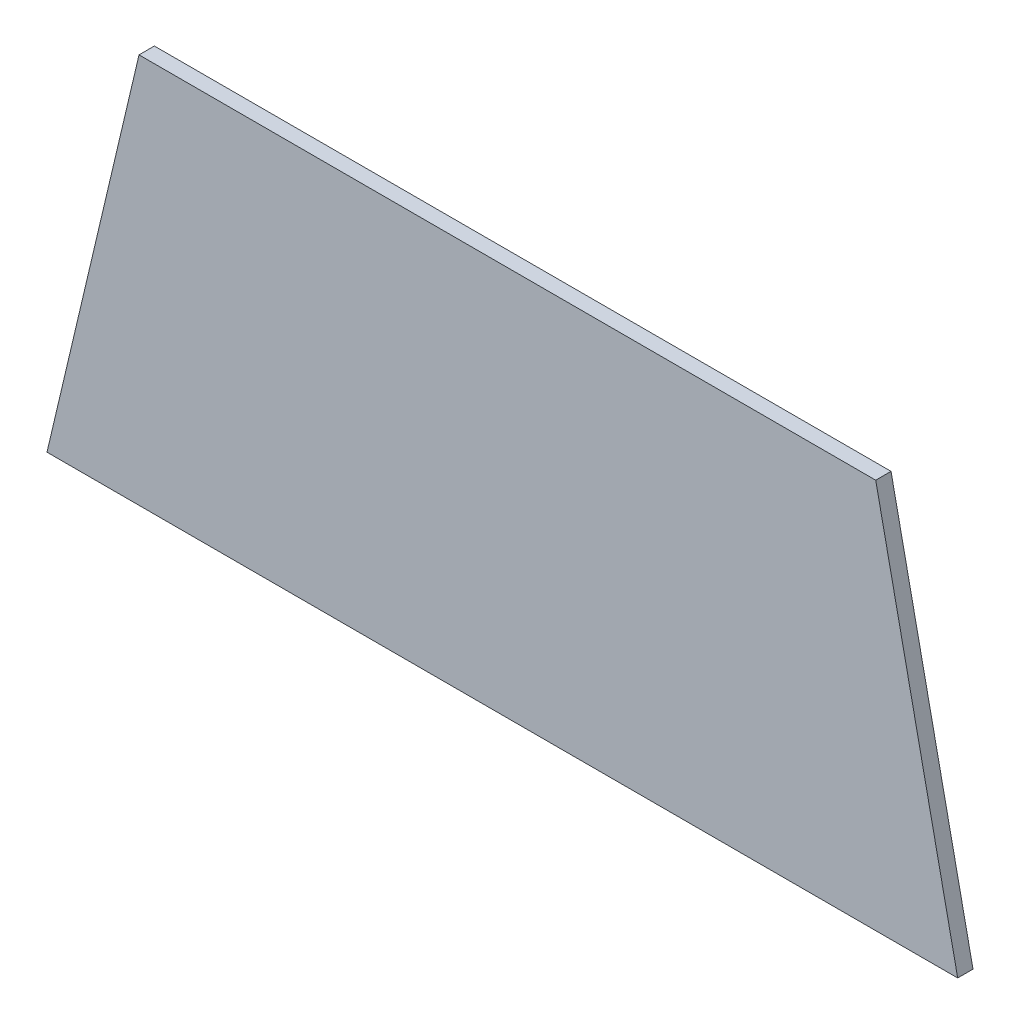
ISO-10303-21;
HEADER;
FILE_DESCRIPTION(('STEP AP214'),'2;1');
FILE_NAME('part.step','',(''),(''),'','','');
FILE_SCHEMA(('AUTOMOTIVE_DESIGN { 1 0 10303 214 1 1 1 1 }'));
ENDSEC;
DATA;
#1=APPLICATION_CONTEXT('core data for automotive mechanical design processes');
#2=APPLICATION_PROTOCOL_DEFINITION('international standard','automotive_design',2000,#1);
#3=PRODUCT_CONTEXT('',#1,'mechanical');
#4=PRODUCT('Part','Part','',(#3));
#5=PRODUCT_RELATED_PRODUCT_CATEGORY('part','',(#4));
#6=PRODUCT_DEFINITION_FORMATION('','',#4);
#7=PRODUCT_DEFINITION_CONTEXT('part definition',#1,'design');
#8=PRODUCT_DEFINITION('design','',#6,#7);
#9=PRODUCT_DEFINITION_SHAPE('','',#8);
#10=(LENGTH_UNIT() NAMED_UNIT(*) SI_UNIT(.MILLI.,.METRE.));
#11=(NAMED_UNIT(*) PLANE_ANGLE_UNIT() SI_UNIT($,.RADIAN.));
#12=(NAMED_UNIT(*) SI_UNIT($,.STERADIAN.) SOLID_ANGLE_UNIT());
#13=UNCERTAINTY_MEASURE_WITH_UNIT(LENGTH_MEASURE(1.E-05),#10,'distance_accuracy_value','');
#14=(GEOMETRIC_REPRESENTATION_CONTEXT(3) GLOBAL_UNCERTAINTY_ASSIGNED_CONTEXT((#13)) GLOBAL_UNIT_ASSIGNED_CONTEXT((#10,
#11,#12)) REPRESENTATION_CONTEXT('',''));
#15=CARTESIAN_POINT('',(0.,0.,0.));
#16=DIRECTION('',(0.,0.,1.));
#17=DIRECTION('',(1.,0.,0.));
#18=AXIS2_PLACEMENT_3D('',#15,#16,#17);
#19=CARTESIAN_POINT('',(-81.9215058635921,-237.357033995104,3.));
#20=DIRECTION('',(0.,1.,0.));
#21=DIRECTION('',(0.,0.,1.));
#22=AXIS2_PLACEMENT_3D('',#19,#20,#21);
#23=PLANE('',#22);
#24=DIRECTION('',(1.,0.,0.));
#25=VECTOR('',#24,1.);
#26=CARTESIAN_POINT('',(-81.9215058635921,-237.357033995104,0.));
#27=LINE('',#26,#25);
#28=CARTESIAN_POINT('',(-81.9215058635921,-237.357033995104,0.));
#29=VERTEX_POINT('',#28);
#30=CARTESIAN_POINT('',(96.3137316190011,-237.357033995104,0.));
#31=VERTEX_POINT('',#30);
#32=EDGE_CURVE('E96',#29,#31,#27,.T.);
#33=ORIENTED_EDGE('',*,*,#32,.T.);
#34=DIRECTION('',(0.,0.,-1.));
#35=VECTOR('',#34,1.);
#36=CARTESIAN_POINT('',(96.3137316190011,-237.357033995104,3.));
#37=LINE('',#36,#35);
#38=CARTESIAN_POINT('',(96.3137316190011,-237.357033995104,3.));
#39=VERTEX_POINT('',#38);
#40=EDGE_CURVE('E11',#39,#31,#37,.T.);
#41=ORIENTED_EDGE('',*,*,#40,.F.);
#42=DIRECTION('',(1.,0.,0.));
#43=VECTOR('',#42,1.);
#44=CARTESIAN_POINT('',(-81.9215058635921,-237.357033995104,3.));
#45=LINE('',#44,#43);
#46=CARTESIAN_POINT('',(-81.9215058635921,-237.357033995104,3.));
#47=VERTEX_POINT('',#46);
#48=EDGE_CURVE('E84',#47,#39,#45,.T.);
#49=ORIENTED_EDGE('',*,*,#48,.F.);
#50=DIRECTION('',(0.,0.,-1.));
#51=VECTOR('',#50,1.);
#52=CARTESIAN_POINT('',(-81.9215058635921,-237.357033995104,3.));
#53=LINE('',#52,#51);
#54=EDGE_CURVE('E92',#47,#29,#53,.T.);
#55=ORIENTED_EDGE('',*,*,#54,.T.);
#56=EDGE_LOOP('',(#33,#41,#49,#55));
#57=FACE_BOUND('',#56,.T.);
#58=ADVANCED_FACE('F33',(#57),#23,.F.);
#59=CARTESIAN_POINT('',(96.3137316190011,-237.357033995104,3.));
#60=DIRECTION('',(-0.978630464421154,-0.205626880798298,0.));
#61=DIRECTION('',(0.205626880798298,-0.978630464421154,0.));
#62=AXIS2_PLACEMENT_3D('',#59,#60,#61);
#63=PLANE('',#62);
#64=DIRECTION('',(-0.205626880798298,0.978630464421154,0.));
#65=VECTOR('',#64,1.);
#66=CARTESIAN_POINT('',(96.3137316190011,-237.357033995104,0.));
#67=LINE('',#66,#65);
#68=CARTESIAN_POINT('',(80.2702253982788,-161.001919903138,0.));
#69=VERTEX_POINT('',#68);
#70=EDGE_CURVE('E88',#31,#69,#67,.T.);
#71=ORIENTED_EDGE('',*,*,#70,.T.);
#72=DIRECTION('',(0.,0.,-1.));
#73=VECTOR('',#72,1.);
#74=CARTESIAN_POINT('',(80.2702253982788,-161.001919903138,3.));
#75=LINE('',#74,#73);
#76=CARTESIAN_POINT('',(80.2702253982788,-161.001919903138,3.));
#77=VERTEX_POINT('',#76);
#78=EDGE_CURVE('E41',#77,#69,#75,.T.);
#79=ORIENTED_EDGE('',*,*,#78,.F.);
#80=DIRECTION('',(-0.205626880798298,0.978630464421154,0.));
#81=VECTOR('',#80,1.);
#82=CARTESIAN_POINT('',(96.3137316190011,-237.357033995104,3.));
#83=LINE('',#82,#81);
#84=EDGE_CURVE('E79',#39,#77,#83,.T.);
#85=ORIENTED_EDGE('',*,*,#84,.F.);
#86=ORIENTED_EDGE('',*,*,#40,.T.);
#87=EDGE_LOOP('',(#71,#79,#85,#86));
#88=FACE_BOUND('',#87,.T.);
#89=ADVANCED_FACE('F87',(#88),#63,.F.);
#90=CARTESIAN_POINT('',(80.2702253982788,-161.001919903138,3.));
#91=DIRECTION('',(0.,-1.,0.));
#92=DIRECTION('',(0.,0.,-1.));
#93=AXIS2_PLACEMENT_3D('',#90,#91,#92);
#94=PLANE('',#93);
#95=DIRECTION('',(-1.,0.,0.));
#96=VECTOR('',#95,1.);
#97=CARTESIAN_POINT('',(80.2702253982788,-161.001919903138,0.));
#98=LINE('',#97,#96);
#99=CARTESIAN_POINT('',(-63.9090166782239,-161.001919903138,0.));
#100=VERTEX_POINT('',#99);
#101=EDGE_CURVE('E66',#69,#100,#98,.T.);
#102=ORIENTED_EDGE('',*,*,#101,.T.);
#103=DIRECTION('',(0.,0.,-1.));
#104=VECTOR('',#103,1.);
#105=CARTESIAN_POINT('',(-63.9090166782239,-161.001919903138,3.));
#106=LINE('',#105,#104);
#107=CARTESIAN_POINT('',(-63.9090166782239,-161.001919903138,3.));
#108=VERTEX_POINT('',#107);
#109=EDGE_CURVE('E89',#108,#100,#106,.T.);
#110=ORIENTED_EDGE('',*,*,#109,.F.);
#111=DIRECTION('',(-1.,0.,0.));
#112=VECTOR('',#111,1.);
#113=CARTESIAN_POINT('',(80.2702253982788,-161.001919903138,3.));
#114=LINE('',#113,#112);
#115=EDGE_CURVE('E82',#77,#108,#114,.T.);
#116=ORIENTED_EDGE('',*,*,#115,.F.);
#117=ORIENTED_EDGE('',*,*,#78,.T.);
#118=EDGE_LOOP('',(#102,#110,#116,#117));
#119=FACE_BOUND('',#118,.T.);
#120=ADVANCED_FACE('F90',(#119),#94,.F.);
#121=CARTESIAN_POINT('',(-63.9090166782239,-161.001919903138,3.));
#122=DIRECTION('',(0.973284629472567,-0.229601894662146,0.));
#123=DIRECTION('',(0.229601894662146,0.973284629472567,0.));
#124=AXIS2_PLACEMENT_3D('',#121,#122,#123);
#125=PLANE('',#124);
#126=DIRECTION('',(-0.229601894662146,-0.973284629472567,0.));
#127=VECTOR('',#126,1.);
#128=CARTESIAN_POINT('',(-63.9090166782239,-161.001919903138,0.));
#129=LINE('',#128,#127);
#130=EDGE_CURVE('E72',#100,#29,#129,.T.);
#131=ORIENTED_EDGE('',*,*,#130,.T.);
#132=ORIENTED_EDGE('',*,*,#54,.F.);
#133=DIRECTION('',(-0.229601894662146,-0.973284629472567,0.));
#134=VECTOR('',#133,1.);
#135=CARTESIAN_POINT('',(-63.9090166782239,-161.001919903138,3.));
#136=LINE('',#135,#134);
#137=EDGE_CURVE('E49',#108,#47,#136,.T.);
#138=ORIENTED_EDGE('',*,*,#137,.F.);
#139=ORIENTED_EDGE('',*,*,#109,.T.);
#140=EDGE_LOOP('',(#131,#132,#138,#139));
#141=FACE_BOUND('',#140,.T.);
#142=ADVANCED_FACE('F103',(#141),#125,.F.);
#143=CARTESIAN_POINT('',(0.,0.,3.));
#144=DIRECTION('',(0.,0.,1.));
#145=DIRECTION('',(1.,0.,0.));
#146=AXIS2_PLACEMENT_3D('',#143,#144,#145);
#147=PLANE('',#146);
#148=ORIENTED_EDGE('',*,*,#48,.T.);
#149=ORIENTED_EDGE('',*,*,#84,.T.);
#150=ORIENTED_EDGE('',*,*,#115,.T.);
#151=ORIENTED_EDGE('',*,*,#137,.T.);
#152=EDGE_LOOP('',(#148,#149,#150,#151));
#153=FACE_BOUND('',#152,.T.);
#154=ADVANCED_FACE('F80',(#153),#147,.T.);
#155=CARTESIAN_POINT('',(0.,0.,0.));
#156=DIRECTION('',(0.,0.,1.));
#157=DIRECTION('',(1.,0.,0.));
#158=AXIS2_PLACEMENT_3D('',#155,#156,#157);
#159=PLANE('',#158);
#160=ORIENTED_EDGE('',*,*,#32,.F.);
#161=ORIENTED_EDGE('',*,*,#130,.F.);
#162=ORIENTED_EDGE('',*,*,#101,.F.);
#163=ORIENTED_EDGE('',*,*,#70,.F.);
#164=EDGE_LOOP('',(#160,#161,#162,#163));
#165=FACE_BOUND('',#164,.T.);
#166=ADVANCED_FACE('F106',(#165),#159,.F.);
#167=CLOSED_SHELL('',(#58,#89,#120,#142,#154,#166));
#168=MANIFOLD_SOLID_BREP('B2',#167);
#169=ADVANCED_BREP_SHAPE_REPRESENTATION('',(#18,#168),#14);
#170=SHAPE_DEFINITION_REPRESENTATION(#9,#169);
ENDSEC;
END-ISO-10303-21;
